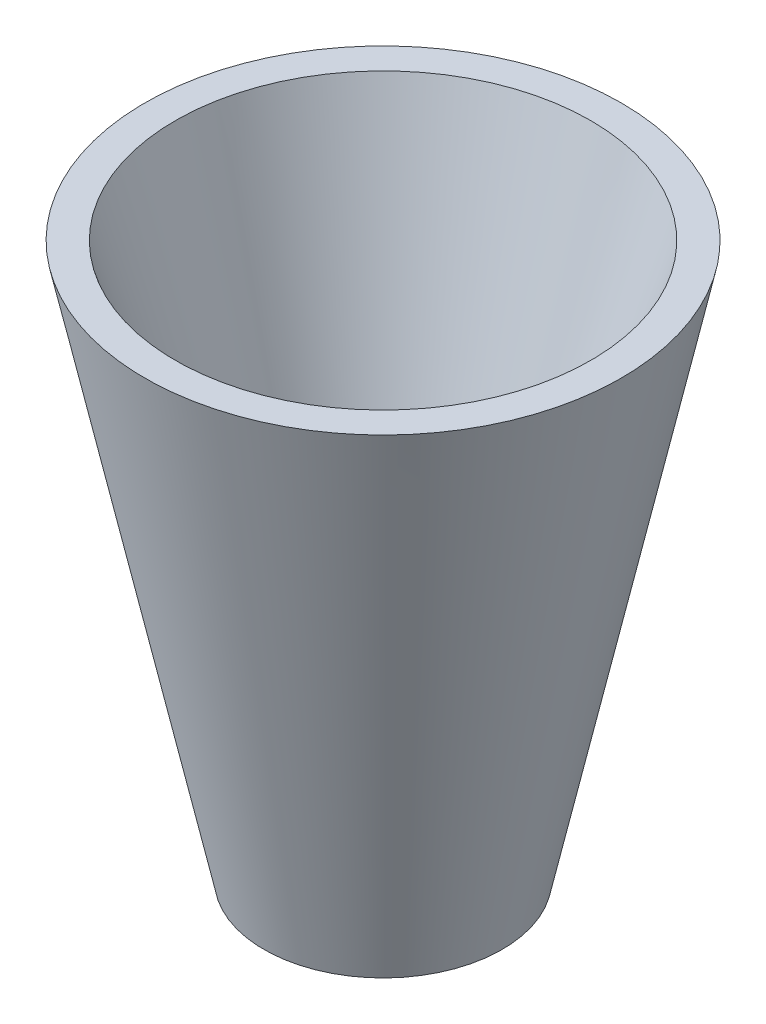
ISO-10303-21;
HEADER;
FILE_DESCRIPTION(('STEP AP214'),'2;1');
FILE_NAME('part.step','',(''),(''),'','','');
FILE_SCHEMA(('AUTOMOTIVE_DESIGN { 1 0 10303 214 1 1 1 1 }'));
ENDSEC;
DATA;
#1=APPLICATION_CONTEXT('core data for automotive mechanical design processes');
#2=APPLICATION_PROTOCOL_DEFINITION('international standard','automotive_design',2000,#1);
#3=PRODUCT_CONTEXT('',#1,'mechanical');
#4=PRODUCT('Part','Part','',(#3));
#5=PRODUCT_RELATED_PRODUCT_CATEGORY('part','',(#4));
#6=PRODUCT_DEFINITION_FORMATION('','',#4);
#7=PRODUCT_DEFINITION_CONTEXT('part definition',#1,'design');
#8=PRODUCT_DEFINITION('design','',#6,#7);
#9=PRODUCT_DEFINITION_SHAPE('','',#8);
#10=(LENGTH_UNIT() NAMED_UNIT(*) SI_UNIT(.MILLI.,.METRE.));
#11=(NAMED_UNIT(*) PLANE_ANGLE_UNIT() SI_UNIT($,.RADIAN.));
#12=(NAMED_UNIT(*) SI_UNIT($,.STERADIAN.) SOLID_ANGLE_UNIT());
#13=UNCERTAINTY_MEASURE_WITH_UNIT(LENGTH_MEASURE(1.E-05),#10,'distance_accuracy_value','');
#14=(GEOMETRIC_REPRESENTATION_CONTEXT(3) GLOBAL_UNCERTAINTY_ASSIGNED_CONTEXT((#13)) GLOBAL_UNIT_ASSIGNED_CONTEXT((#10,
#11,#12)) REPRESENTATION_CONTEXT('',''));
#15=CARTESIAN_POINT('',(0.,0.,0.));
#16=DIRECTION('',(0.,0.,1.));
#17=DIRECTION('',(1.,0.,0.));
#18=AXIS2_PLACEMENT_3D('',#15,#16,#17);
#19=CARTESIAN_POINT('',(0.,19.812,0.));
#20=DIRECTION('',(0.,-1.,0.));
#21=DIRECTION('',(1.,0.,0.));
#22=AXIS2_PLACEMENT_3D('',#19,#20,#21);
#23=SPHERICAL_SURFACE('',#22,9.652);
#24=CARTESIAN_POINT('',(0.,16.9828850001817,0.));
#25=DIRECTION('',(0.,-1.,0.));
#26=DIRECTION('',(0.,0.,-1.));
#27=AXIS2_PLACEMENT_3D('',#24,#25,#26);
#28=CIRCLE('',#27,9.22806655360717);
#29=CARTESIAN_POINT('',(0.,16.9828850001817,-9.22806655360717));
#30=VERTEX_POINT('',#29);
#31=EDGE_CURVE('E10',#30,#30,#28,.T.);
#32=ORIENTED_EDGE('',*,*,#31,.F.);
#33=EDGE_LOOP('',(#32));
#34=FACE_BOUND('',#33,.T.);
#35=ADVANCED_FACE('F31',(#34),#23,.F.);
#36=CARTESIAN_POINT('',(0.,59.1003871904065,0.));
#37=DIRECTION('',(0.,1.,0.));
#38=DIRECTION('',(0.,0.,1.));
#39=AXIS2_PLACEMENT_3D('',#36,#37,#38);
#40=CONICAL_SURFACE('',#39,22.1403333333333,0.297479965862811);
#41=ORIENTED_EDGE('',*,*,#31,.T.);
#42=EDGE_LOOP('',(#41));
#43=FACE_BOUND('',#42,.T.);
#44=CARTESIAN_POINT('',(0.,59.1003871904065,0.));
#45=DIRECTION('',(0.,-1.,0.));
#46=DIRECTION('',(0.,0.,-1.));
#47=AXIS2_PLACEMENT_3D('',#44,#45,#46);
#48=CIRCLE('',#47,22.1403333333333);
#49=CARTESIAN_POINT('',(0.,59.1003871904065,-22.1403333333333));
#50=VERTEX_POINT('',#49);
#51=EDGE_CURVE('E37',#50,#50,#48,.T.);
#52=ORIENTED_EDGE('',*,*,#51,.F.);
#53=EDGE_LOOP('',(#52));
#54=FACE_BOUND('',#53,.T.);
#55=ADVANCED_FACE('F63',(#43,#54),#40,.F.);
#56=CARTESIAN_POINT('',(25.4,59.1003871904065,0.));
#57=DIRECTION('',(0.,1.,0.));
#58=DIRECTION('',(0.,0.,1.));
#59=AXIS2_PLACEMENT_3D('',#56,#57,#58);
#60=PLANE('',#59);
#61=ORIENTED_EDGE('',*,*,#51,.T.);
#62=EDGE_LOOP('',(#61));
#63=FACE_BOUND('',#62,.T.);
#64=CARTESIAN_POINT('',(0.,59.1003871904065,0.));
#65=DIRECTION('',(0.,-1.,0.));
#66=DIRECTION('',(0.,0.,-1.));
#67=AXIS2_PLACEMENT_3D('',#64,#65,#66);
#68=CIRCLE('',#67,25.4);
#69=CARTESIAN_POINT('',(0.,59.1003871904065,-25.4));
#70=VERTEX_POINT('',#69);
#71=EDGE_CURVE('E41',#70,#70,#68,.T.);
#72=ORIENTED_EDGE('',*,*,#71,.F.);
#73=EDGE_LOOP('',(#72));
#74=FACE_BOUND('',#73,.T.);
#75=ADVANCED_FACE('F55',(#63,#74),#60,.T.);
#76=CARTESIAN_POINT('',(0.,0.,0.));
#77=DIRECTION('',(0.,1.,0.));
#78=DIRECTION('',(0.,0.,1.));
#79=AXIS2_PLACEMENT_3D('',#76,#77,#78);
#80=CONICAL_SURFACE('',#79,12.7,0.211669688219069);
#81=ORIENTED_EDGE('',*,*,#71,.T.);
#82=EDGE_LOOP('',(#81));
#83=FACE_BOUND('',#82,.T.);
#84=CARTESIAN_POINT('',(0.,0.,0.));
#85=DIRECTION('',(0.,-1.,0.));
#86=DIRECTION('',(0.,0.,-1.));
#87=AXIS2_PLACEMENT_3D('',#84,#85,#86);
#88=CIRCLE('',#87,12.7);
#89=CARTESIAN_POINT('',(0.,0.,-12.7));
#90=VERTEX_POINT('',#89);
#91=EDGE_CURVE('E45',#90,#90,#88,.T.);
#92=ORIENTED_EDGE('',*,*,#91,.F.);
#93=EDGE_LOOP('',(#92));
#94=FACE_BOUND('',#93,.T.);
#95=ADVANCED_FACE('F53',(#83,#94),#80,.T.);
#96=CARTESIAN_POINT('',(0.,0.,0.));
#97=DIRECTION('',(0.,-1.,0.));
#98=DIRECTION('',(0.,0.,-1.));
#99=AXIS2_PLACEMENT_3D('',#96,#97,#98);
#100=PLANE('',#99);
#101=ORIENTED_EDGE('',*,*,#91,.T.);
#102=EDGE_LOOP('',(#101));
#103=FACE_BOUND('',#102,.T.);
#104=ADVANCED_FACE('F51',(#103),#100,.T.);
#105=CLOSED_SHELL('',(#35,#55,#75,#95,#104));
#106=MANIFOLD_SOLID_BREP('B2',#105);
#107=ADVANCED_BREP_SHAPE_REPRESENTATION('',(#18,#106),#14);
#108=SHAPE_DEFINITION_REPRESENTATION(#9,#107);
ENDSEC;
END-ISO-10303-21;
